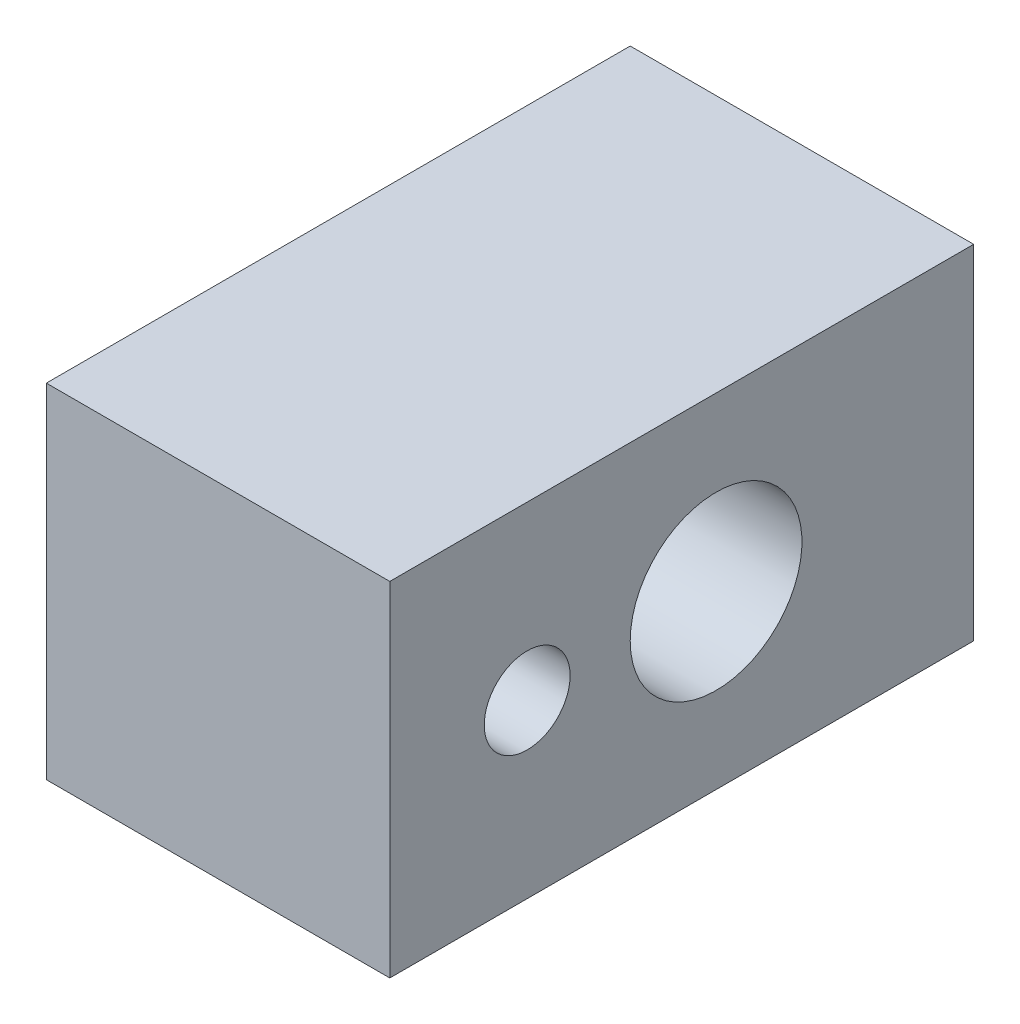
ISO-10303-21;
HEADER;
FILE_DESCRIPTION(('STEP AP214'),'2;1');
FILE_NAME('part.step','',(''),(''),'','','');
FILE_SCHEMA(('AUTOMOTIVE_DESIGN { 1 0 10303 214 1 1 1 1 }'));
ENDSEC;
DATA;
#1=APPLICATION_CONTEXT('core data for automotive mechanical design processes');
#2=APPLICATION_PROTOCOL_DEFINITION('international standard','automotive_design',2000,#1);
#3=PRODUCT_CONTEXT('',#1,'mechanical');
#4=PRODUCT('Part','Part','',(#3));
#5=PRODUCT_RELATED_PRODUCT_CATEGORY('part','',(#4));
#6=PRODUCT_DEFINITION_FORMATION('','',#4);
#7=PRODUCT_DEFINITION_CONTEXT('part definition',#1,'design');
#8=PRODUCT_DEFINITION('design','',#6,#7);
#9=PRODUCT_DEFINITION_SHAPE('','',#8);
#10=(LENGTH_UNIT() NAMED_UNIT(*) SI_UNIT(.MILLI.,.METRE.));
#11=(NAMED_UNIT(*) PLANE_ANGLE_UNIT() SI_UNIT($,.RADIAN.));
#12=(NAMED_UNIT(*) SI_UNIT($,.STERADIAN.) SOLID_ANGLE_UNIT());
#13=UNCERTAINTY_MEASURE_WITH_UNIT(LENGTH_MEASURE(1.E-05),#10,'distance_accuracy_value','');
#14=(GEOMETRIC_REPRESENTATION_CONTEXT(3) GLOBAL_UNCERTAINTY_ASSIGNED_CONTEXT((#13)) GLOBAL_UNIT_ASSIGNED_CONTEXT((#10,
#11,#12)) REPRESENTATION_CONTEXT('',''));
#15=CARTESIAN_POINT('',(0.,0.,0.));
#16=DIRECTION('',(0.,0.,1.));
#17=DIRECTION('',(1.,0.,0.));
#18=AXIS2_PLACEMENT_3D('',#15,#16,#17);
#19=CARTESIAN_POINT('',(0.,0.,17.));
#20=DIRECTION('',(-1.,0.,0.));
#21=DIRECTION('',(0.,0.,1.));
#22=AXIS2_PLACEMENT_3D('',#19,#20,#21);
#23=PLANE('',#22);
#24=CARTESIAN_POINT('',(0.,5.,7.5));
#25=DIRECTION('',(-1.,0.,0.));
#26=DIRECTION('',(0.,0.,1.));
#27=AXIS2_PLACEMENT_3D('',#24,#25,#26);
#28=CIRCLE('',#27,2.5);
#29=CARTESIAN_POINT('',(0.,5.,10.));
#30=VERTEX_POINT('',#29);
#31=EDGE_CURVE('E94',#30,#30,#28,.T.);
#32=ORIENTED_EDGE('',*,*,#31,.T.);
#33=EDGE_LOOP('',(#32));
#34=FACE_BOUND('',#33,.T.);
#35=DIRECTION('',(0.,1.,0.));
#36=VECTOR('',#35,1.);
#37=CARTESIAN_POINT('',(0.,0.,0.));
#38=LINE('',#37,#36);
#39=CARTESIAN_POINT('',(0.,0.,0.));
#40=VERTEX_POINT('',#39);
#41=CARTESIAN_POINT('',(0.,10.,0.));
#42=VERTEX_POINT('',#41);
#43=EDGE_CURVE('E77',#40,#42,#38,.T.);
#44=ORIENTED_EDGE('',*,*,#43,.T.);
#45=DIRECTION('',(0.,0.,-1.));
#46=VECTOR('',#45,1.);
#47=CARTESIAN_POINT('',(0.,10.,17.));
#48=LINE('',#47,#46);
#49=CARTESIAN_POINT('',(0.,10.,17.));
#50=VERTEX_POINT('',#49);
#51=EDGE_CURVE('E11',#50,#42,#48,.T.);
#52=ORIENTED_EDGE('',*,*,#51,.F.);
#53=DIRECTION('',(0.,1.,0.));
#54=VECTOR('',#53,1.);
#55=CARTESIAN_POINT('',(0.,0.,17.));
#56=LINE('',#55,#54);
#57=CARTESIAN_POINT('',(0.,0.,17.));
#58=VERTEX_POINT('',#57);
#59=EDGE_CURVE('E101',#58,#50,#56,.T.);
#60=ORIENTED_EDGE('',*,*,#59,.F.);
#61=DIRECTION('',(0.,0.,-1.));
#62=VECTOR('',#61,1.);
#63=CARTESIAN_POINT('',(0.,0.,17.));
#64=LINE('',#63,#62);
#65=EDGE_CURVE('E90',#58,#40,#64,.T.);
#66=ORIENTED_EDGE('',*,*,#65,.T.);
#67=EDGE_LOOP('',(#44,#52,#60,#66));
#68=FACE_BOUND('',#67,.T.);
#69=CARTESIAN_POINT('',(0.,5.,13.));
#70=DIRECTION('',(1.,0.,0.));
#71=DIRECTION('',(0.,0.,-1.));
#72=AXIS2_PLACEMENT_3D('',#69,#70,#71);
#73=CIRCLE('',#72,1.24999999999999);
#74=CARTESIAN_POINT('',(0.,5.,11.75));
#75=VERTEX_POINT('',#74);
#76=EDGE_CURVE('E136',#75,#75,#73,.T.);
#77=ORIENTED_EDGE('',*,*,#76,.F.);
#78=EDGE_LOOP('',(#77));
#79=FACE_BOUND('',#78,.T.);
#80=ADVANCED_FACE('F28',(#34,#68,#79),#23,.F.);
#81=CARTESIAN_POINT('',(-10.,0.,17.));
#82=DIRECTION('',(1.,0.,0.));
#83=DIRECTION('',(0.,0.,-1.));
#84=AXIS2_PLACEMENT_3D('',#81,#82,#83);
#85=PLANE('',#84);
#86=CARTESIAN_POINT('',(-10.,5.,13.));
#87=DIRECTION('',(1.,0.,0.));
#88=DIRECTION('',(0.,0.,-1.));
#89=AXIS2_PLACEMENT_3D('',#86,#87,#88);
#90=CIRCLE('',#89,1.25);
#91=CARTESIAN_POINT('',(-10.,5.,11.75));
#92=VERTEX_POINT('',#91);
#93=EDGE_CURVE('E138',#92,#92,#90,.T.);
#94=ORIENTED_EDGE('',*,*,#93,.T.);
#95=EDGE_LOOP('',(#94));
#96=FACE_BOUND('',#95,.T.);
#97=DIRECTION('',(0.,-1.,0.));
#98=VECTOR('',#97,1.);
#99=CARTESIAN_POINT('',(-10.,0.,0.));
#100=LINE('',#99,#98);
#101=CARTESIAN_POINT('',(-10.,10.,0.));
#102=VERTEX_POINT('',#101);
#103=CARTESIAN_POINT('',(-10.,0.,0.));
#104=VERTEX_POINT('',#103);
#105=EDGE_CURVE('E78',#102,#104,#100,.T.);
#106=ORIENTED_EDGE('',*,*,#105,.T.);
#107=DIRECTION('',(0.,0.,-1.));
#108=VECTOR('',#107,1.);
#109=CARTESIAN_POINT('',(-10.,0.,17.));
#110=LINE('',#109,#108);
#111=CARTESIAN_POINT('',(-10.,0.,17.));
#112=VERTEX_POINT('',#111);
#113=EDGE_CURVE('E107',#112,#104,#110,.T.);
#114=ORIENTED_EDGE('',*,*,#113,.F.);
#115=DIRECTION('',(0.,-1.,0.));
#116=VECTOR('',#115,1.);
#117=CARTESIAN_POINT('',(-10.,0.,17.));
#118=LINE('',#117,#116);
#119=CARTESIAN_POINT('',(-10.,10.,17.));
#120=VERTEX_POINT('',#119);
#121=EDGE_CURVE('E52',#120,#112,#118,.T.);
#122=ORIENTED_EDGE('',*,*,#121,.F.);
#123=DIRECTION('',(0.,0.,-1.));
#124=VECTOR('',#123,1.);
#125=CARTESIAN_POINT('',(-10.,10.,17.));
#126=LINE('',#125,#124);
#127=EDGE_CURVE('E40',#120,#102,#126,.T.);
#128=ORIENTED_EDGE('',*,*,#127,.T.);
#129=EDGE_LOOP('',(#106,#114,#122,#128));
#130=FACE_BOUND('',#129,.T.);
#131=CARTESIAN_POINT('',(-10.,5.,7.5));
#132=DIRECTION('',(-1.,0.,0.));
#133=DIRECTION('',(0.,0.,1.));
#134=AXIS2_PLACEMENT_3D('',#131,#132,#133);
#135=CIRCLE('',#134,2.5);
#136=CARTESIAN_POINT('',(-10.,5.,10.));
#137=VERTEX_POINT('',#136);
#138=EDGE_CURVE('E91',#137,#137,#135,.T.);
#139=ORIENTED_EDGE('',*,*,#138,.F.);
#140=EDGE_LOOP('',(#139));
#141=FACE_BOUND('',#140,.T.);
#142=ADVANCED_FACE('F111',(#96,#130,#141),#85,.F.);
#143=CARTESIAN_POINT('',(0.,10.,17.));
#144=DIRECTION('',(0.,-1.,0.));
#145=DIRECTION('',(1.,0.,0.));
#146=AXIS2_PLACEMENT_3D('',#143,#144,#145);
#147=PLANE('',#146);
#148=DIRECTION('',(-1.,0.,0.));
#149=VECTOR('',#148,1.);
#150=CARTESIAN_POINT('',(0.,10.,0.));
#151=LINE('',#150,#149);
#152=EDGE_CURVE('E73',#42,#102,#151,.T.);
#153=ORIENTED_EDGE('',*,*,#152,.T.);
#154=ORIENTED_EDGE('',*,*,#127,.F.);
#155=DIRECTION('',(-1.,0.,0.));
#156=VECTOR('',#155,1.);
#157=CARTESIAN_POINT('',(0.,10.,17.));
#158=LINE('',#157,#156);
#159=EDGE_CURVE('E85',#50,#120,#158,.T.);
#160=ORIENTED_EDGE('',*,*,#159,.F.);
#161=ORIENTED_EDGE('',*,*,#51,.T.);
#162=EDGE_LOOP('',(#153,#154,#160,#161));
#163=FACE_BOUND('',#162,.T.);
#164=ADVANCED_FACE('F84',(#163),#147,.F.);
#165=CARTESIAN_POINT('',(0.,0.,17.));
#166=DIRECTION('',(0.,1.,0.));
#167=DIRECTION('',(-1.,0.,0.));
#168=AXIS2_PLACEMENT_3D('',#165,#166,#167);
#169=PLANE('',#168);
#170=DIRECTION('',(1.,0.,0.));
#171=VECTOR('',#170,1.);
#172=CARTESIAN_POINT('',(0.,0.,0.));
#173=LINE('',#172,#171);
#174=EDGE_CURVE('E99',#104,#40,#173,.T.);
#175=ORIENTED_EDGE('',*,*,#174,.T.);
#176=ORIENTED_EDGE('',*,*,#65,.F.);
#177=DIRECTION('',(1.,0.,0.));
#178=VECTOR('',#177,1.);
#179=CARTESIAN_POINT('',(0.,0.,17.));
#180=LINE('',#179,#178);
#181=EDGE_CURVE('E47',#112,#58,#180,.T.);
#182=ORIENTED_EDGE('',*,*,#181,.F.);
#183=ORIENTED_EDGE('',*,*,#113,.T.);
#184=EDGE_LOOP('',(#175,#176,#182,#183));
#185=FACE_BOUND('',#184,.T.);
#186=ADVANCED_FACE('F114',(#185),#169,.F.);
#187=CARTESIAN_POINT('',(0.,0.,17.));
#188=DIRECTION('',(0.,0.,1.));
#189=DIRECTION('',(1.,0.,0.));
#190=AXIS2_PLACEMENT_3D('',#187,#188,#189);
#191=PLANE('',#190);
#192=ORIENTED_EDGE('',*,*,#59,.T.);
#193=ORIENTED_EDGE('',*,*,#159,.T.);
#194=ORIENTED_EDGE('',*,*,#121,.T.);
#195=ORIENTED_EDGE('',*,*,#181,.T.);
#196=EDGE_LOOP('',(#192,#193,#194,#195));
#197=FACE_BOUND('',#196,.T.);
#198=ADVANCED_FACE('F115',(#197),#191,.T.);
#199=CARTESIAN_POINT('',(0.,0.,0.));
#200=DIRECTION('',(0.,0.,1.));
#201=DIRECTION('',(1.,0.,0.));
#202=AXIS2_PLACEMENT_3D('',#199,#200,#201);
#203=PLANE('',#202);
#204=CARTESIAN_POINT('',(-5.,5.,0.));
#205=DIRECTION('',(0.,0.,-1.));
#206=DIRECTION('',(-1.,0.,0.));
#207=AXIS2_PLACEMENT_3D('',#204,#205,#206);
#208=CIRCLE('',#207,1.65);
#209=CARTESIAN_POINT('',(-6.65,5.,0.));
#210=VERTEX_POINT('',#209);
#211=EDGE_CURVE('E143',#210,#210,#208,.T.);
#212=ORIENTED_EDGE('',*,*,#211,.F.);
#213=EDGE_LOOP('',(#212));
#214=FACE_BOUND('',#213,.T.);
#215=ORIENTED_EDGE('',*,*,#43,.F.);
#216=ORIENTED_EDGE('',*,*,#174,.F.);
#217=ORIENTED_EDGE('',*,*,#105,.F.);
#218=ORIENTED_EDGE('',*,*,#152,.F.);
#219=EDGE_LOOP('',(#215,#216,#217,#218));
#220=FACE_BOUND('',#219,.T.);
#221=ADVANCED_FACE('F74',(#214,#220),#203,.F.);
#222=CARTESIAN_POINT('',(-10.,5.,7.5));
#223=DIRECTION('',(1.,0.,0.));
#224=DIRECTION('',(0.,0.,-1.));
#225=AXIS2_PLACEMENT_3D('',#222,#223,#224);
#226=CYLINDRICAL_SURFACE('',#225,2.5);
#227=CARTESIAN_POINT('',(-6.65,5.,5.));
#228=CARTESIAN_POINT('',(-6.64999873137196,4.91694260162676,5.00000126450997));
#229=CARTESIAN_POINT('',(-6.64369332813588,4.83387293496895,5.00417590334817));
#230=CARTESIAN_POINT('',(-6.61885588365078,4.67037243521448,5.02046206329035));
#231=CARTESIAN_POINT('',(-6.60031631385544,4.58994325901025,5.03257847149475));
#232=CARTESIAN_POINT('',(-6.55213728113011,4.43433320472429,5.06354921676191));
#233=CARTESIAN_POINT('',(-6.52254993559189,4.35912962041461,5.08237189846887));
#234=CARTESIAN_POINT('',(-6.45352693083465,4.21504904186959,5.12523480432594));
#235=CARTESIAN_POINT('',(-6.4140899859757,4.14617287514047,5.1492757095421));
#236=CARTESIAN_POINT('',(-6.32286952215449,4.01016313395322,5.20304338850387));
#237=CARTESIAN_POINT('',(-6.27032656825891,3.94366330169811,5.23307831223154));
#238=CARTESIAN_POINT('',(-6.15618952097826,3.81981714873078,5.29501154362026));
#239=CARTESIAN_POINT('',(-6.09458262017789,3.76248402385126,5.32691244885645));
#240=CARTESIAN_POINT('',(-5.95302539379477,3.649568508045,5.39493215351785));
#241=CARTESIAN_POINT('',(-5.87171133088717,3.59561789758189,5.43094323724307));
#242=CARTESIAN_POINT('',(-5.69912083324243,3.50223006796888,5.49750748166395));
#243=CARTESIAN_POINT('',(-5.60786198860459,3.46276774573526,5.52807003500371));
#244=CARTESIAN_POINT('',(-5.44413560527636,3.40927509427373,5.57115995070316));
#245=CARTESIAN_POINT('',(-5.37369396916483,3.391204764162,5.58634429599675));
#246=CARTESIAN_POINT('',(-5.2299018511051,3.36446600734635,5.60914156575963));
#247=CARTESIAN_POINT('',(-5.15655644550119,3.35578186415895,5.61676714504879));
#248=CARTESIAN_POINT('',(-5.00867667417278,3.34835738763389,5.62327248722709));
#249=CARTESIAN_POINT('',(-4.93413884652659,3.3496550134457,5.62211886432326));
#250=CARTESIAN_POINT('',(-4.78652353828438,3.36218889070079,5.6111810576896));
#251=CARTESIAN_POINT('',(-4.7134473445196,3.37343353695153,5.60138958404777));
#252=CARTESIAN_POINT('',(-4.57363241128316,3.4044937514479,5.57522853742529));
#253=CARTESIAN_POINT('',(-4.50675695986501,3.4239457579938,5.55913987952512));
#254=CARTESIAN_POINT('',(-4.37715045890062,3.47052089736296,5.52222991869437));
#255=CARTESIAN_POINT('',(-4.31442077815267,3.4976465483183,5.50140706266191));
#256=CARTESIAN_POINT('',(-4.18145090678,3.56504440579459,5.45232655300661));
#257=CARTESIAN_POINT('',(-4.11223771034803,3.60686345276235,5.42341588928163));
#258=CARTESIAN_POINT('',(-3.9810080681833,3.69975793336633,5.36401818528251));
#259=CARTESIAN_POINT('',(-3.91900059332767,3.75084470668484,5.33352924691086));
#260=CARTESIAN_POINT('',(-3.79079581751367,3.87318324887289,5.26704742874657));
#261=CARTESIAN_POINT('',(-3.72638563153817,3.94642027087872,5.23122080894989));
#262=CARTESIAN_POINT('',(-3.61069375916494,4.1045148561132,5.16430895478889));
#263=CARTESIAN_POINT('',(-3.55939926885102,4.18936096101381,5.13321910833));
#264=CARTESIAN_POINT('',(-3.48076937013591,4.35126057372792,5.08446418365695));
#265=CARTESIAN_POINT('',(-3.45070429619159,4.42655359241198,5.06536086225206));
#266=CARTESIAN_POINT('',(-3.40174403146117,4.58202394862611,5.0339165853933));
#267=CARTESIAN_POINT('',(-3.38283949361835,4.66219713670471,5.02156997176618));
#268=CARTESIAN_POINT('',(-3.35714787455097,4.82563324042858,5.00473096720373));
#269=CARTESIAN_POINT('',(-3.35041003867469,4.9089073264901,5.00027049735215));
#270=CARTESIAN_POINT('',(-3.34962658503506,5.07554547714737,4.99975367421623));
#271=CARTESIAN_POINT('',(-3.35558054764824,5.15890953867722,5.00369704307938));
#272=CARTESIAN_POINT('',(-3.37899822975948,5.31759099506673,5.01905723699095));
#273=CARTESIAN_POINT('',(-3.39567875181353,5.39307690591727,5.0299651852417));
#274=CARTESIAN_POINT('',(-3.43896514344754,5.5399400991023,5.05785818213673));
#275=CARTESIAN_POINT('',(-3.46557260717726,5.61131671940696,5.07484420683047));
#276=CARTESIAN_POINT('',(-3.52968198695996,5.75306190056643,5.11490711037443));
#277=CARTESIAN_POINT('',(-3.56777480993121,5.82306998904366,5.13830561270023));
#278=CARTESIAN_POINT('',(-3.65282892231759,5.95596244403478,5.18889612355589));
#279=CARTESIAN_POINT('',(-3.69979606297082,6.01884206641326,5.21609063185565));
#280=CARTESIAN_POINT('',(-3.80961080419749,6.14612838724312,5.27691400645398));
#281=CARTESIAN_POINT('',(-3.87379416920505,6.20922126106421,5.31088232635296));
#282=CARTESIAN_POINT('',(-4.01166557220157,6.32429793175259,5.37851672940833));
#283=CARTESIAN_POINT('',(-4.08535908217024,6.37627528682548,5.41218262653368));
#284=CARTESIAN_POINT('',(-4.23370339941786,6.46353640050703,5.4725409445534));
#285=CARTESIAN_POINT('',(-4.30752954809478,6.49996651133877,5.49959392243236));
#286=CARTESIAN_POINT('',(-4.4614963190488,6.56184713022858,5.54752140874581));
#287=CARTESIAN_POINT('',(-4.54162522591712,6.58731746510718,5.56840705254997));
#288=CARTESIAN_POINT('',(-4.69279856186901,6.62268199450879,5.59806726835512));
#289=CARTESIAN_POINT('',(-4.76310833243817,6.63447382745328,5.60828682193227));
#290=CARTESIAN_POINT('',(-4.90533882936876,6.64882828119084,5.62078129726468));
#291=CARTESIAN_POINT('',(-4.97725794428712,6.65139975183535,5.6230638370293));
#292=CARTESIAN_POINT('',(-5.12059113363752,6.64714925615308,5.61933394324013));
#293=CARTESIAN_POINT('',(-5.19200519040373,6.64032696287034,5.61332122096444));
#294=CARTESIAN_POINT('',(-5.33240243452481,6.61773943894528,5.59392209022066));
#295=CARTESIAN_POINT('',(-5.40138228582659,6.60196240572203,5.58052595089171));
#296=CARTESIAN_POINT('',(-5.55417079765174,6.55672361400764,5.54355481480736));
#297=CARTESIAN_POINT('',(-5.63677236327342,6.52467713481425,5.51818558118498));
#298=CARTESIAN_POINT('',(-5.79439420967663,6.44883296418163,5.46208337355519));
#299=CARTESIAN_POINT('',(-5.86940375646762,6.40501894611546,5.43134296829229));
#300=CARTESIAN_POINT('',(-6.01234437962016,6.30588975445997,5.36735067905984));
#301=CARTESIAN_POINT('',(-6.08013166298805,6.25038987560408,5.3340647141154));
#302=CARTESIAN_POINT('',(-6.20635347060613,6.1291028716024,5.26843437424434));
#303=CARTESIAN_POINT('',(-6.2647853046465,6.06331279816866,5.23609027233511));
#304=CARTESIAN_POINT('',(-6.37783171013876,5.91322410952674,5.171155147123));
#305=CARTESIAN_POINT('',(-6.43103774089958,5.82763791148048,5.13904646483098));
#306=CARTESIAN_POINT('',(-6.52162979943429,5.64604949716313,5.08306219996444));
#307=CARTESIAN_POINT('',(-6.55904531806631,5.55006712240414,5.05917128520927));
#308=CARTESIAN_POINT('',(-6.60788092445762,5.3780291357627,5.02764430823965));
#309=CARTESIAN_POINT('',(-6.62360538601068,5.30366474423014,5.01735345165048));
#310=CARTESIAN_POINT('',(-6.64466271697479,5.15286961075776,5.00353253120019));
#311=CARTESIAN_POINT('',(-6.65000116755317,5.07644000101308,4.99999883623681));
#312=CARTESIAN_POINT('',(-6.65,5.,5.));
#313=B_SPLINE_CURVE_WITH_KNOTS('',3,(#227,#228,#229,#230,#231,#232,#233,#234,#235,#236,#237,
#238,#239,#240,#241,#242,#243,#244,#245,#246,#247,#248,#249,#250,#251,#252,#253,#254,#255,#256,
#257,#258,#259,#260,#261,#262,#263,#264,#265,#266,#267,#268,#269,#270,#271,#272,#273,#274,#275,
#276,#277,#278,#279,#280,#281,#282,#283,#284,#285,#286,#287,#288,#289,#290,#291,#292,#293,#294,
#295,#296,#297,#298,#299,#300,#301,#302,#303,#304,#305,#306,#307,#308,#309,#310,#311,#312),
.UNSPECIFIED.,.T.,.F.,(4,2,2,2,2,2,2,2,2,2,2,2,2,2,2,2,2,2,2,2,2,2,2,2,2,2,2,2,2,2,2,2,2,2,2,2,
2,2,2,2,2,2,4),(0.,0.248863173219164,0.497879632505738,0.745735911637784,0.993624559661682,
1.26236142699035,1.53148173454876,1.84208059721148,2.15213873331274,2.37412103166174,
2.59573105830194,2.81818424963007,3.0408253600701,3.25449658913793,3.4682380166321,
3.7249687979368,3.98201585159,4.2922411296606,4.60216239062962,4.8509948640788,5.09961864119514,
5.34924649914315,5.5988661038809,5.83205917661708,6.06528971354039,6.31352952087294,
6.5619335787085,6.84938688817398,7.13700633715916,7.39601090345959,7.65454492637288,
7.86965548867985,8.08455952907284,8.29947104952727,8.51466648895039,8.78967221613734,
9.06506148314461,9.34518323893305,9.62538540113005,9.94089155188799,10.2558058174589,
10.484964597082,10.7140001987933),.UNSPECIFIED.);
#314=CARTESIAN_POINT('',(-6.65,5.,5.));
#315=VERTEX_POINT('',#314);
#316=EDGE_CURVE('E31',#315,#315,#313,.T.);
#317=ORIENTED_EDGE('',*,*,#316,.F.);
#318=EDGE_LOOP('',(#317));
#319=FACE_BOUND('',#318,.T.);
#320=ORIENTED_EDGE('',*,*,#138,.T.);
#321=EDGE_LOOP('',(#320));
#322=FACE_BOUND('',#321,.T.);
#323=ORIENTED_EDGE('',*,*,#31,.F.);
#324=EDGE_LOOP('',(#323));
#325=FACE_BOUND('',#324,.T.);
#326=ADVANCED_FACE('F123',(#319,#322,#325),#226,.F.);
#327=CARTESIAN_POINT('',(0.,5.,13.));
#328=DIRECTION('',(1.,0.,0.));
#329=DIRECTION('',(0.,0.,-1.));
#330=AXIS2_PLACEMENT_3D('',#327,#328,#329);
#331=CYLINDRICAL_SURFACE('',#330,1.24999999999999);
#332=ORIENTED_EDGE('',*,*,#93,.F.);
#333=EDGE_LOOP('',(#332));
#334=FACE_BOUND('',#333,.T.);
#335=ORIENTED_EDGE('',*,*,#76,.T.);
#336=EDGE_LOOP('',(#335));
#337=FACE_BOUND('',#336,.T.);
#338=ADVANCED_FACE('F154',(#334,#337),#331,.F.);
#339=CARTESIAN_POINT('',(-5.,5.,0.));
#340=DIRECTION('',(0.,0.,-1.));
#341=DIRECTION('',(-1.,0.,0.));
#342=AXIS2_PLACEMENT_3D('',#339,#340,#341);
#343=CYLINDRICAL_SURFACE('',#342,1.65);
#344=ORIENTED_EDGE('',*,*,#316,.T.);
#345=EDGE_LOOP('',(#344));
#346=FACE_BOUND('',#345,.T.);
#347=ORIENTED_EDGE('',*,*,#211,.T.);
#348=EDGE_LOOP('',(#347));
#349=FACE_BOUND('',#348,.T.);
#350=ADVANCED_FACE('F150',(#346,#349),#343,.F.);
#351=CLOSED_SHELL('',(#80,#142,#164,#186,#198,#221,#326,#338,#350));
#352=MANIFOLD_SOLID_BREP('B2',#351);
#353=ADVANCED_BREP_SHAPE_REPRESENTATION('',(#18,#352),#14);
#354=SHAPE_DEFINITION_REPRESENTATION(#9,#353);
ENDSEC;
END-ISO-10303-21;
